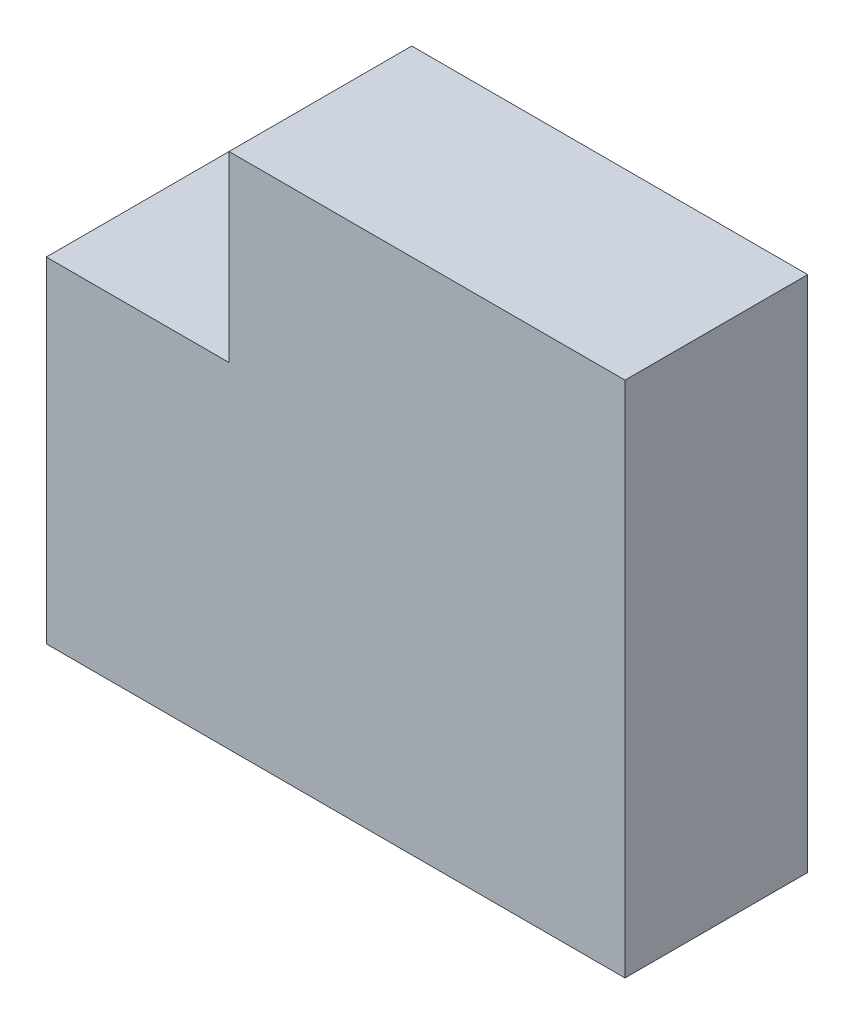
ISO-10303-21;
HEADER;
FILE_DESCRIPTION(('STEP AP214'),'2;1');
FILE_NAME('part.step','',(''),(''),'','','');
FILE_SCHEMA(('AUTOMOTIVE_DESIGN { 1 0 10303 214 1 1 1 1 }'));
ENDSEC;
DATA;
#1=APPLICATION_CONTEXT('core data for automotive mechanical design processes');
#2=APPLICATION_PROTOCOL_DEFINITION('international standard','automotive_design',2000,#1);
#3=PRODUCT_CONTEXT('',#1,'mechanical');
#4=PRODUCT('Part','Part','',(#3));
#5=PRODUCT_RELATED_PRODUCT_CATEGORY('part','',(#4));
#6=PRODUCT_DEFINITION_FORMATION('','',#4);
#7=PRODUCT_DEFINITION_CONTEXT('part definition',#1,'design');
#8=PRODUCT_DEFINITION('design','',#6,#7);
#9=PRODUCT_DEFINITION_SHAPE('','',#8);
#10=(LENGTH_UNIT() NAMED_UNIT(*) SI_UNIT(.MILLI.,.METRE.));
#11=(NAMED_UNIT(*) PLANE_ANGLE_UNIT() SI_UNIT($,.RADIAN.));
#12=(NAMED_UNIT(*) SI_UNIT($,.STERADIAN.) SOLID_ANGLE_UNIT());
#13=UNCERTAINTY_MEASURE_WITH_UNIT(LENGTH_MEASURE(1.E-05),#10,'distance_accuracy_value','');
#14=(GEOMETRIC_REPRESENTATION_CONTEXT(3) GLOBAL_UNCERTAINTY_ASSIGNED_CONTEXT((#13)) GLOBAL_UNIT_ASSIGNED_CONTEXT((#10,
#11,#12)) REPRESENTATION_CONTEXT('',''));
#15=CARTESIAN_POINT('',(0.,0.,0.));
#16=DIRECTION('',(0.,0.,1.));
#17=DIRECTION('',(1.,0.,0.));
#18=AXIS2_PLACEMENT_3D('',#15,#16,#17);
#19=CARTESIAN_POINT('',(19.,0.,6.));
#20=DIRECTION('',(1.,0.,0.));
#21=DIRECTION('',(0.,0.,-1.));
#22=AXIS2_PLACEMENT_3D('',#19,#20,#21);
#23=PLANE('',#22);
#24=DIRECTION('',(0.,-1.,0.));
#25=VECTOR('',#24,1.);
#26=CARTESIAN_POINT('',(19.,0.,0.));
#27=LINE('',#26,#25);
#28=CARTESIAN_POINT('',(19.,17.,0.));
#29=VERTEX_POINT('',#28);
#30=CARTESIAN_POINT('',(19.,0.,0.));
#31=VERTEX_POINT('',#30);
#32=EDGE_CURVE('E127',#29,#31,#27,.T.);
#33=ORIENTED_EDGE('',*,*,#32,.F.);
#34=DIRECTION('',(0.,0.,-1.));
#35=VECTOR('',#34,1.);
#36=CARTESIAN_POINT('',(19.,17.,6.));
#37=LINE('',#36,#35);
#38=CARTESIAN_POINT('',(19.,17.,6.));
#39=VERTEX_POINT('',#38);
#40=EDGE_CURVE('E11',#39,#29,#37,.T.);
#41=ORIENTED_EDGE('',*,*,#40,.F.);
#42=DIRECTION('',(0.,-1.,0.));
#43=VECTOR('',#42,1.);
#44=CARTESIAN_POINT('',(19.,0.,6.));
#45=LINE('',#44,#43);
#46=CARTESIAN_POINT('',(19.,0.,6.));
#47=VERTEX_POINT('',#46);
#48=EDGE_CURVE('E147',#39,#47,#45,.T.);
#49=ORIENTED_EDGE('',*,*,#48,.T.);
#50=DIRECTION('',(0.,0.,-1.));
#51=VECTOR('',#50,1.);
#52=CARTESIAN_POINT('',(19.,0.,6.));
#53=LINE('',#52,#51);
#54=EDGE_CURVE('E86',#47,#31,#53,.T.);
#55=ORIENTED_EDGE('',*,*,#54,.T.);
#56=EDGE_LOOP('',(#33,#41,#49,#55));
#57=FACE_BOUND('',#56,.T.);
#58=ADVANCED_FACE('F41',(#57),#23,.T.);
#59=CARTESIAN_POINT('',(0.,17.,6.));
#60=DIRECTION('',(0.,1.,0.));
#61=DIRECTION('',(0.,0.,1.));
#62=AXIS2_PLACEMENT_3D('',#59,#60,#61);
#63=PLANE('',#62);
#64=DIRECTION('',(1.,0.,0.));
#65=VECTOR('',#64,1.);
#66=CARTESIAN_POINT('',(0.,17.,0.));
#67=LINE('',#66,#65);
#68=CARTESIAN_POINT('',(6.,17.,0.));
#69=VERTEX_POINT('',#68);
#70=EDGE_CURVE('E131',#69,#29,#67,.T.);
#71=ORIENTED_EDGE('',*,*,#70,.F.);
#72=DIRECTION('',(0.,0.,-1.));
#73=VECTOR('',#72,1.);
#74=CARTESIAN_POINT('',(6.,17.,6.));
#75=LINE('',#74,#73);
#76=CARTESIAN_POINT('',(6.,17.,6.));
#77=VERTEX_POINT('',#76);
#78=EDGE_CURVE('E50',#77,#69,#75,.T.);
#79=ORIENTED_EDGE('',*,*,#78,.F.);
#80=DIRECTION('',(1.,0.,0.));
#81=VECTOR('',#80,1.);
#82=CARTESIAN_POINT('',(0.,17.,6.));
#83=LINE('',#82,#81);
#84=EDGE_CURVE('E163',#77,#39,#83,.T.);
#85=ORIENTED_EDGE('',*,*,#84,.T.);
#86=ORIENTED_EDGE('',*,*,#40,.T.);
#87=EDGE_LOOP('',(#71,#79,#85,#86));
#88=FACE_BOUND('',#87,.T.);
#89=ADVANCED_FACE('F162',(#88),#63,.T.);
#90=CARTESIAN_POINT('',(6.,0.,6.));
#91=DIRECTION('',(1.,0.,0.));
#92=DIRECTION('',(0.,0.,-1.));
#93=AXIS2_PLACEMENT_3D('',#90,#91,#92);
#94=PLANE('',#93);
#95=DIRECTION('',(0.,-1.,0.));
#96=VECTOR('',#95,1.);
#97=CARTESIAN_POINT('',(6.,0.,0.));
#98=LINE('',#97,#96);
#99=CARTESIAN_POINT('',(6.,11.,0.));
#100=VERTEX_POINT('',#99);
#101=EDGE_CURVE('E135',#69,#100,#98,.T.);
#102=ORIENTED_EDGE('',*,*,#101,.T.);
#103=DIRECTION('',(0.,0.,-1.));
#104=VECTOR('',#103,1.);
#105=CARTESIAN_POINT('',(6.,11.,6.));
#106=LINE('',#105,#104);
#107=CARTESIAN_POINT('',(6.,11.,6.));
#108=VERTEX_POINT('',#107);
#109=EDGE_CURVE('E110',#108,#100,#106,.T.);
#110=ORIENTED_EDGE('',*,*,#109,.F.);
#111=DIRECTION('',(0.,-1.,0.));
#112=VECTOR('',#111,1.);
#113=CARTESIAN_POINT('',(6.,0.,6.));
#114=LINE('',#113,#112);
#115=EDGE_CURVE('E116',#77,#108,#114,.T.);
#116=ORIENTED_EDGE('',*,*,#115,.F.);
#117=ORIENTED_EDGE('',*,*,#78,.T.);
#118=EDGE_LOOP('',(#102,#110,#116,#117));
#119=FACE_BOUND('',#118,.T.);
#120=ADVANCED_FACE('F156',(#119),#94,.F.);
#121=CARTESIAN_POINT('',(0.,11.,6.));
#122=DIRECTION('',(0.,1.,0.));
#123=DIRECTION('',(0.,0.,1.));
#124=AXIS2_PLACEMENT_3D('',#121,#122,#123);
#125=PLANE('',#124);
#126=DIRECTION('',(1.,0.,0.));
#127=VECTOR('',#126,1.);
#128=CARTESIAN_POINT('',(0.,11.,0.));
#129=LINE('',#128,#127);
#130=CARTESIAN_POINT('',(0.,11.,0.));
#131=VERTEX_POINT('',#130);
#132=EDGE_CURVE('E104',#131,#100,#129,.T.);
#133=ORIENTED_EDGE('',*,*,#132,.F.);
#134=DIRECTION('',(0.,0.,-1.));
#135=VECTOR('',#134,1.);
#136=CARTESIAN_POINT('',(0.,11.,6.));
#137=LINE('',#136,#135);
#138=CARTESIAN_POINT('',(0.,11.,6.));
#139=VERTEX_POINT('',#138);
#140=EDGE_CURVE('E99',#139,#131,#137,.T.);
#141=ORIENTED_EDGE('',*,*,#140,.F.);
#142=DIRECTION('',(1.,0.,0.));
#143=VECTOR('',#142,1.);
#144=CARTESIAN_POINT('',(0.,11.,6.));
#145=LINE('',#144,#143);
#146=EDGE_CURVE('E102',#139,#108,#145,.T.);
#147=ORIENTED_EDGE('',*,*,#146,.T.);
#148=ORIENTED_EDGE('',*,*,#109,.T.);
#149=EDGE_LOOP('',(#133,#141,#147,#148));
#150=FACE_BOUND('',#149,.T.);
#151=ADVANCED_FACE('F101',(#150),#125,.T.);
#152=CARTESIAN_POINT('',(0.,0.,6.));
#153=DIRECTION('',(-1.,0.,0.));
#154=DIRECTION('',(0.,-1.,0.));
#155=AXIS2_PLACEMENT_3D('',#152,#153,#154);
#156=PLANE('',#155);
#157=DIRECTION('',(0.,1.,0.));
#158=VECTOR('',#157,1.);
#159=CARTESIAN_POINT('',(0.,0.,0.));
#160=LINE('',#159,#158);
#161=CARTESIAN_POINT('',(0.,0.,0.));
#162=VERTEX_POINT('',#161);
#163=EDGE_CURVE('E141',#162,#131,#160,.T.);
#164=ORIENTED_EDGE('',*,*,#163,.F.);
#165=DIRECTION('',(0.,0.,-1.));
#166=VECTOR('',#165,1.);
#167=CARTESIAN_POINT('',(0.,0.,6.));
#168=LINE('',#167,#166);
#169=CARTESIAN_POINT('',(0.,0.,6.));
#170=VERTEX_POINT('',#169);
#171=EDGE_CURVE('E79',#170,#162,#168,.T.);
#172=ORIENTED_EDGE('',*,*,#171,.F.);
#173=DIRECTION('',(0.,1.,0.));
#174=VECTOR('',#173,1.);
#175=CARTESIAN_POINT('',(0.,0.,6.));
#176=LINE('',#175,#174);
#177=EDGE_CURVE('E113',#170,#139,#176,.T.);
#178=ORIENTED_EDGE('',*,*,#177,.T.);
#179=ORIENTED_EDGE('',*,*,#140,.T.);
#180=EDGE_LOOP('',(#164,#172,#178,#179));
#181=FACE_BOUND('',#180,.T.);
#182=ADVANCED_FACE('F120',(#181),#156,.T.);
#183=CARTESIAN_POINT('',(0.,0.,6.));
#184=DIRECTION('',(0.,1.,0.));
#185=DIRECTION('',(0.,0.,1.));
#186=AXIS2_PLACEMENT_3D('',#183,#184,#185);
#187=PLANE('',#186);
#188=DIRECTION('',(1.,0.,0.));
#189=VECTOR('',#188,1.);
#190=CARTESIAN_POINT('',(0.,0.,0.));
#191=LINE('',#190,#189);
#192=EDGE_CURVE('E144',#162,#31,#191,.T.);
#193=ORIENTED_EDGE('',*,*,#192,.T.);
#194=ORIENTED_EDGE('',*,*,#54,.F.);
#195=DIRECTION('',(1.,0.,0.));
#196=VECTOR('',#195,1.);
#197=CARTESIAN_POINT('',(0.,0.,6.));
#198=LINE('',#197,#196);
#199=EDGE_CURVE('E58',#170,#47,#198,.T.);
#200=ORIENTED_EDGE('',*,*,#199,.F.);
#201=ORIENTED_EDGE('',*,*,#171,.T.);
#202=EDGE_LOOP('',(#193,#194,#200,#201));
#203=FACE_BOUND('',#202,.T.);
#204=ADVANCED_FACE('F164',(#203),#187,.F.);
#205=CARTESIAN_POINT('',(0.,0.,6.));
#206=DIRECTION('',(0.,0.,1.));
#207=DIRECTION('',(1.,0.,0.));
#208=AXIS2_PLACEMENT_3D('',#205,#206,#207);
#209=PLANE('',#208);
#210=ORIENTED_EDGE('',*,*,#48,.F.);
#211=ORIENTED_EDGE('',*,*,#84,.F.);
#212=ORIENTED_EDGE('',*,*,#115,.T.);
#213=ORIENTED_EDGE('',*,*,#146,.F.);
#214=ORIENTED_EDGE('',*,*,#177,.F.);
#215=ORIENTED_EDGE('',*,*,#199,.T.);
#216=EDGE_LOOP('',(#210,#211,#212,#213,#214,#215));
#217=FACE_BOUND('',#216,.T.);
#218=ADVANCED_FACE('F112',(#217),#209,.T.);
#219=CARTESIAN_POINT('',(0.,0.,0.));
#220=DIRECTION('',(0.,0.,1.));
#221=DIRECTION('',(1.,0.,0.));
#222=AXIS2_PLACEMENT_3D('',#219,#220,#221);
#223=PLANE('',#222);
#224=ORIENTED_EDGE('',*,*,#32,.T.);
#225=ORIENTED_EDGE('',*,*,#192,.F.);
#226=ORIENTED_EDGE('',*,*,#163,.T.);
#227=ORIENTED_EDGE('',*,*,#132,.T.);
#228=ORIENTED_EDGE('',*,*,#101,.F.);
#229=ORIENTED_EDGE('',*,*,#70,.T.);
#230=EDGE_LOOP('',(#224,#225,#226,#227,#228,#229));
#231=FACE_BOUND('',#230,.T.);
#232=ADVANCED_FACE('F161',(#231),#223,.F.);
#233=CLOSED_SHELL('',(#58,#89,#120,#151,#182,#204,#218,#232));
#234=MANIFOLD_SOLID_BREP('B2',#233);
#235=ADVANCED_BREP_SHAPE_REPRESENTATION('',(#18,#234),#14);
#236=SHAPE_DEFINITION_REPRESENTATION(#9,#235);
ENDSEC;
END-ISO-10303-21;
